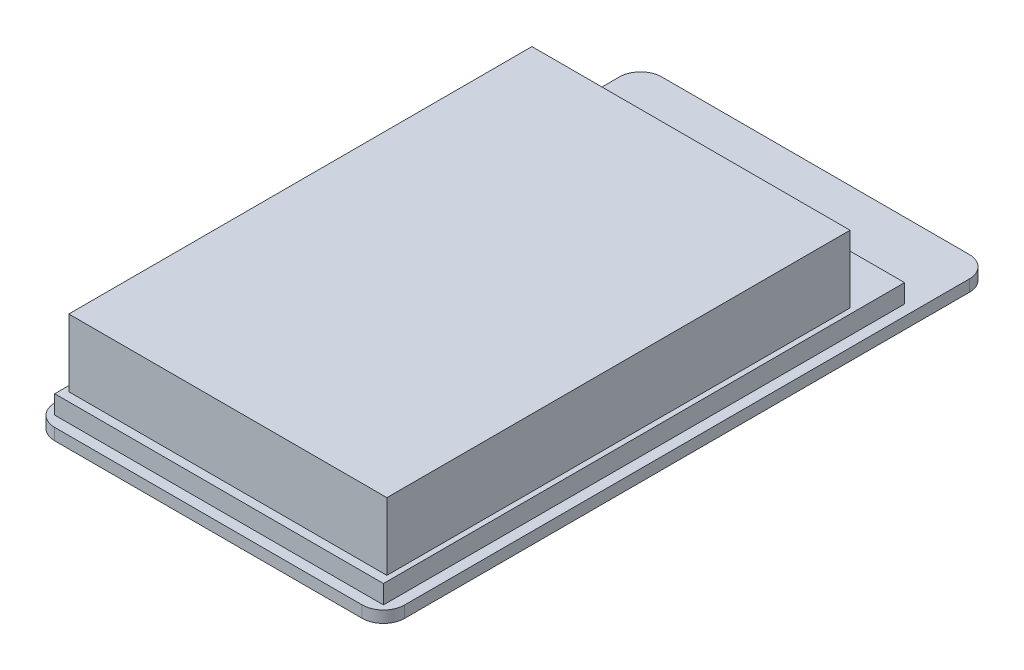
ISO-10303-21;
HEADER;
FILE_DESCRIPTION(('STEP AP214'),'2;1');
FILE_NAME('part.step','',(''),(''),'','','');
FILE_SCHEMA(('AUTOMOTIVE_DESIGN { 1 0 10303 214 1 1 1 1 }'));
ENDSEC;
DATA;
#1=APPLICATION_CONTEXT('core data for automotive mechanical design processes');
#2=APPLICATION_PROTOCOL_DEFINITION('international standard','automotive_design',2000,#1);
#3=PRODUCT_CONTEXT('',#1,'mechanical');
#4=PRODUCT('Part','Part','',(#3));
#5=PRODUCT_RELATED_PRODUCT_CATEGORY('part','',(#4));
#6=PRODUCT_DEFINITION_FORMATION('','',#4);
#7=PRODUCT_DEFINITION_CONTEXT('part definition',#1,'design');
#8=PRODUCT_DEFINITION('design','',#6,#7);
#9=PRODUCT_DEFINITION_SHAPE('','',#8);
#10=(LENGTH_UNIT() NAMED_UNIT(*) SI_UNIT(.MILLI.,.METRE.));
#11=(NAMED_UNIT(*) PLANE_ANGLE_UNIT() SI_UNIT($,.RADIAN.));
#12=(NAMED_UNIT(*) SI_UNIT($,.STERADIAN.) SOLID_ANGLE_UNIT());
#13=UNCERTAINTY_MEASURE_WITH_UNIT(LENGTH_MEASURE(1.E-05),#10,'distance_accuracy_value','');
#14=(GEOMETRIC_REPRESENTATION_CONTEXT(3) GLOBAL_UNCERTAINTY_ASSIGNED_CONTEXT((#13)) GLOBAL_UNIT_ASSIGNED_CONTEXT((#10,
#11,#12)) REPRESENTATION_CONTEXT('',''));
#15=CARTESIAN_POINT('',(0.,0.,0.));
#16=DIRECTION('',(0.,0.,1.));
#17=DIRECTION('',(1.,0.,0.));
#18=AXIS2_PLACEMENT_3D('',#15,#16,#17);
#19=CARTESIAN_POINT('',(0.,5.7,0.));
#20=DIRECTION('',(0.,1.,0.));
#21=DIRECTION('',(0.,0.,1.));
#22=AXIS2_PLACEMENT_3D('',#19,#20,#21);
#23=PLANE('',#22);
#24=DIRECTION('',(0.,0.,1.));
#25=VECTOR('',#24,1.);
#26=CARTESIAN_POINT('',(-31.,5.7,-43.05));
#27=LINE('',#26,#25);
#28=CARTESIAN_POINT('',(-31.,5.7,-43.05));
#29=VERTEX_POINT('',#28);
#30=CARTESIAN_POINT('',(-31.,5.7,55.25));
#31=VERTEX_POINT('',#30);
#32=EDGE_CURVE('E179',#29,#31,#27,.T.);
#33=ORIENTED_EDGE('',*,*,#32,.T.);
#34=DIRECTION('',(1.,0.,0.));
#35=VECTOR('',#34,1.);
#36=CARTESIAN_POINT('',(-31.,5.7,55.25));
#37=LINE('',#36,#35);
#38=CARTESIAN_POINT('',(31.,5.7,55.25));
#39=VERTEX_POINT('',#38);
#40=EDGE_CURVE('E182',#31,#39,#37,.T.);
#41=ORIENTED_EDGE('',*,*,#40,.T.);
#42=DIRECTION('',(0.,0.,-1.));
#43=VECTOR('',#42,1.);
#44=CARTESIAN_POINT('',(31.,5.7,-43.05));
#45=LINE('',#44,#43);
#46=CARTESIAN_POINT('',(31.,5.7,-43.05));
#47=VERTEX_POINT('',#46);
#48=EDGE_CURVE('E185',#39,#47,#45,.T.);
#49=ORIENTED_EDGE('',*,*,#48,.T.);
#50=DIRECTION('',(-1.,0.,0.));
#51=VECTOR('',#50,1.);
#52=CARTESIAN_POINT('',(-31.,5.7,-43.05));
#53=LINE('',#52,#51);
#54=EDGE_CURVE('E187',#47,#29,#53,.T.);
#55=ORIENTED_EDGE('',*,*,#54,.T.);
#56=EDGE_LOOP('',(#33,#41,#49,#55));
#57=FACE_BOUND('',#56,.T.);
#58=DIRECTION('',(1.,0.,0.));
#59=VECTOR('',#58,1.);
#60=CARTESIAN_POINT('',(-30.,5.7,53.6));
#61=LINE('',#60,#59);
#62=CARTESIAN_POINT('',(-30.,5.7,53.6));
#63=VERTEX_POINT('',#62);
#64=CARTESIAN_POINT('',(30.,5.7,53.6));
#65=VERTEX_POINT('',#64);
#66=EDGE_CURVE('E442',#63,#65,#61,.T.);
#67=ORIENTED_EDGE('',*,*,#66,.F.);
#68=DIRECTION('',(0.,0.,1.));
#69=VECTOR('',#68,1.);
#70=CARTESIAN_POINT('',(-30.,5.7,-33.7647170423504));
#71=LINE('',#70,#69);
#72=CARTESIAN_POINT('',(-30.,5.7,-33.7647170423504));
#73=VERTEX_POINT('',#72);
#74=EDGE_CURVE('E169',#73,#63,#71,.T.);
#75=ORIENTED_EDGE('',*,*,#74,.F.);
#76=DIRECTION('',(-1.,0.,0.));
#77=VECTOR('',#76,1.);
#78=CARTESIAN_POINT('',(-30.,5.7,-33.7647170423504));
#79=LINE('',#78,#77);
#80=CARTESIAN_POINT('',(30.,5.7,-33.7647170423504));
#81=VERTEX_POINT('',#80);
#82=EDGE_CURVE('E165',#81,#73,#79,.T.);
#83=ORIENTED_EDGE('',*,*,#82,.F.);
#84=DIRECTION('',(0.,0.,-1.));
#85=VECTOR('',#84,1.);
#86=CARTESIAN_POINT('',(30.,5.7,-33.7647170423504));
#87=LINE('',#86,#85);
#88=EDGE_CURVE('E439',#65,#81,#87,.T.);
#89=ORIENTED_EDGE('',*,*,#88,.F.);
#90=EDGE_LOOP('',(#67,#75,#83,#89));
#91=FACE_BOUND('',#90,.T.);
#92=ADVANCED_FACE('F32',(#57,#91),#23,.T.);
#93=CARTESIAN_POINT('',(0.,2.2,0.));
#94=DIRECTION('',(0.,1.,0.));
#95=DIRECTION('',(0.,0.,1.));
#96=AXIS2_PLACEMENT_3D('',#93,#94,#95);
#97=PLANE('',#96);
#98=DIRECTION('',(0.,0.,-1.));
#99=VECTOR('',#98,1.);
#100=CARTESIAN_POINT('',(33.,2.2,-57.25));
#101=LINE('',#100,#99);
#102=CARTESIAN_POINT('',(33.,2.2,53.25));
#103=VERTEX_POINT('',#102);
#104=CARTESIAN_POINT('',(33.,2.2,-53.25));
#105=VERTEX_POINT('',#104);
#106=EDGE_CURVE('E210',#103,#105,#101,.T.);
#107=ORIENTED_EDGE('',*,*,#106,.T.);
#108=CARTESIAN_POINT('',(29.,2.2,-53.25));
#109=DIRECTION('',(0.,1.,0.));
#110=DIRECTION('',(0.,0.,1.));
#111=AXIS2_PLACEMENT_3D('',#108,#109,#110);
#112=CIRCLE('',#111,4.);
#113=CARTESIAN_POINT('',(29.,2.2,-57.25));
#114=VERTEX_POINT('',#113);
#115=EDGE_CURVE('E250',#105,#114,#112,.T.);
#116=ORIENTED_EDGE('',*,*,#115,.T.);
#117=DIRECTION('',(-1.,0.,0.));
#118=VECTOR('',#117,1.);
#119=CARTESIAN_POINT('',(-33.,2.2,-57.25));
#120=LINE('',#119,#118);
#121=CARTESIAN_POINT('',(-29.,2.2,-57.25));
#122=VERTEX_POINT('',#121);
#123=EDGE_CURVE('E213',#114,#122,#120,.T.);
#124=ORIENTED_EDGE('',*,*,#123,.T.);
#125=CARTESIAN_POINT('',(-29.,2.2,-53.25));
#126=DIRECTION('',(0.,1.,0.));
#127=DIRECTION('',(0.,0.,1.));
#128=AXIS2_PLACEMENT_3D('',#125,#126,#127);
#129=CIRCLE('',#128,4.);
#130=CARTESIAN_POINT('',(-33.,2.2,-53.25));
#131=VERTEX_POINT('',#130);
#132=EDGE_CURVE('E248',#122,#131,#129,.T.);
#133=ORIENTED_EDGE('',*,*,#132,.T.);
#134=DIRECTION('',(0.,0.,1.));
#135=VECTOR('',#134,1.);
#136=CARTESIAN_POINT('',(-33.,2.2,-57.25));
#137=LINE('',#136,#135);
#138=CARTESIAN_POINT('',(-33.,2.2,53.25));
#139=VERTEX_POINT('',#138);
#140=EDGE_CURVE('E203',#131,#139,#137,.T.);
#141=ORIENTED_EDGE('',*,*,#140,.T.);
#142=CARTESIAN_POINT('',(-29.,2.2,53.25));
#143=DIRECTION('',(0.,1.,0.));
#144=DIRECTION('',(0.,0.,1.));
#145=AXIS2_PLACEMENT_3D('',#142,#143,#144);
#146=CIRCLE('',#145,4.);
#147=CARTESIAN_POINT('',(-29.,2.2,57.25));
#148=VERTEX_POINT('',#147);
#149=EDGE_CURVE('E246',#139,#148,#146,.T.);
#150=ORIENTED_EDGE('',*,*,#149,.T.);
#151=DIRECTION('',(1.,0.,0.));
#152=VECTOR('',#151,1.);
#153=CARTESIAN_POINT('',(-33.,2.2,57.25));
#154=LINE('',#153,#152);
#155=CARTESIAN_POINT('',(29.,2.2,57.25));
#156=VERTEX_POINT('',#155);
#157=EDGE_CURVE('E206',#148,#156,#154,.T.);
#158=ORIENTED_EDGE('',*,*,#157,.T.);
#159=CARTESIAN_POINT('',(29.,2.2,53.25));
#160=DIRECTION('',(0.,1.,0.));
#161=DIRECTION('',(0.,0.,1.));
#162=AXIS2_PLACEMENT_3D('',#159,#160,#161);
#163=CIRCLE('',#162,4.);
#164=EDGE_CURVE('E244',#156,#103,#163,.T.);
#165=ORIENTED_EDGE('',*,*,#164,.T.);
#166=EDGE_LOOP('',(#107,#116,#124,#133,#141,#150,#158,#165));
#167=FACE_BOUND('',#166,.T.);
#168=DIRECTION('',(1.,0.,0.));
#169=VECTOR('',#168,1.);
#170=CARTESIAN_POINT('',(-31.,2.2,55.25));
#171=LINE('',#170,#169);
#172=CARTESIAN_POINT('',(-31.,2.2,55.25));
#173=VERTEX_POINT('',#172);
#174=CARTESIAN_POINT('',(31.,2.2,55.25));
#175=VERTEX_POINT('',#174);
#176=EDGE_CURVE('E174',#173,#175,#171,.T.);
#177=ORIENTED_EDGE('',*,*,#176,.F.);
#178=DIRECTION('',(0.,0.,1.));
#179=VECTOR('',#178,1.);
#180=CARTESIAN_POINT('',(-31.,2.2,-43.05));
#181=LINE('',#180,#179);
#182=CARTESIAN_POINT('',(-31.,2.2,-43.05));
#183=VERTEX_POINT('',#182);
#184=EDGE_CURVE('E171',#183,#173,#181,.T.);
#185=ORIENTED_EDGE('',*,*,#184,.F.);
#186=DIRECTION('',(-1.,0.,0.));
#187=VECTOR('',#186,1.);
#188=CARTESIAN_POINT('',(-31.,2.2,-43.05));
#189=LINE('',#188,#187);
#190=CARTESIAN_POINT('',(31.,2.2,-43.05));
#191=VERTEX_POINT('',#190);
#192=EDGE_CURVE('E183',#191,#183,#189,.T.);
#193=ORIENTED_EDGE('',*,*,#192,.F.);
#194=DIRECTION('',(0.,0.,-1.));
#195=VECTOR('',#194,1.);
#196=CARTESIAN_POINT('',(31.,2.2,-43.05));
#197=LINE('',#196,#195);
#198=EDGE_CURVE('E191',#175,#191,#197,.T.);
#199=ORIENTED_EDGE('',*,*,#198,.F.);
#200=EDGE_LOOP('',(#177,#185,#193,#199));
#201=FACE_BOUND('',#200,.T.);
#202=ADVANCED_FACE('F265',(#167,#201),#97,.T.);
#203=CARTESIAN_POINT('',(-33.,2.2,-57.25));
#204=DIRECTION('',(1.,0.,0.));
#205=DIRECTION('',(0.,0.,-1.));
#206=AXIS2_PLACEMENT_3D('',#203,#204,#205);
#207=PLANE('',#206);
#208=ORIENTED_EDGE('',*,*,#140,.F.);
#209=DIRECTION('',(0.,-1.,0.));
#210=VECTOR('',#209,1.);
#211=CARTESIAN_POINT('',(-33.,2.2,-53.25));
#212=LINE('',#211,#210);
#213=CARTESIAN_POINT('',(-33.,0.,-53.25));
#214=VERTEX_POINT('',#213);
#215=EDGE_CURVE('E254',#131,#214,#212,.T.);
#216=ORIENTED_EDGE('',*,*,#215,.T.);
#217=DIRECTION('',(0.,0.,1.));
#218=VECTOR('',#217,1.);
#219=CARTESIAN_POINT('',(-33.,0.,-57.25));
#220=LINE('',#219,#218);
#221=CARTESIAN_POINT('',(-33.,0.,53.25));
#222=VERTEX_POINT('',#221);
#223=EDGE_CURVE('E202',#214,#222,#220,.T.);
#224=ORIENTED_EDGE('',*,*,#223,.T.);
#225=DIRECTION('',(0.,-1.,0.));
#226=VECTOR('',#225,1.);
#227=CARTESIAN_POINT('',(-33.,2.2,53.25));
#228=LINE('',#227,#226);
#229=EDGE_CURVE('E252',#222,#139,#228,.F.);
#230=ORIENTED_EDGE('',*,*,#229,.T.);
#231=EDGE_LOOP('',(#208,#216,#224,#230));
#232=FACE_BOUND('',#231,.T.);
#233=ADVANCED_FACE('F292',(#232),#207,.F.);
#234=CARTESIAN_POINT('',(-33.,2.2,57.25));
#235=DIRECTION('',(0.,0.,-1.));
#236=DIRECTION('',(-1.,0.,0.));
#237=AXIS2_PLACEMENT_3D('',#234,#235,#236);
#238=PLANE('',#237);
#239=ORIENTED_EDGE('',*,*,#157,.F.);
#240=DIRECTION('',(0.,-1.,0.));
#241=VECTOR('',#240,1.);
#242=CARTESIAN_POINT('',(-29.,2.2,57.25));
#243=LINE('',#242,#241);
#244=CARTESIAN_POINT('',(-29.,0.,57.25));
#245=VERTEX_POINT('',#244);
#246=EDGE_CURVE('E11',#148,#245,#243,.T.);
#247=ORIENTED_EDGE('',*,*,#246,.T.);
#248=DIRECTION('',(1.,0.,0.));
#249=VECTOR('',#248,1.);
#250=CARTESIAN_POINT('',(-33.,0.,57.25));
#251=LINE('',#250,#249);
#252=CARTESIAN_POINT('',(29.,0.,57.25));
#253=VERTEX_POINT('',#252);
#254=EDGE_CURVE('E219',#245,#253,#251,.T.);
#255=ORIENTED_EDGE('',*,*,#254,.T.);
#256=DIRECTION('',(0.,-1.,0.));
#257=VECTOR('',#256,1.);
#258=CARTESIAN_POINT('',(29.,2.2,57.25));
#259=LINE('',#258,#257);
#260=EDGE_CURVE('E40',#253,#156,#259,.F.);
#261=ORIENTED_EDGE('',*,*,#260,.T.);
#262=EDGE_LOOP('',(#239,#247,#255,#261));
#263=FACE_BOUND('',#262,.T.);
#264=ADVANCED_FACE('F259',(#263),#238,.F.);
#265=CARTESIAN_POINT('',(33.,2.2,-57.25));
#266=DIRECTION('',(-1.,0.,0.));
#267=DIRECTION('',(0.,0.,1.));
#268=AXIS2_PLACEMENT_3D('',#265,#266,#267);
#269=PLANE('',#268);
#270=DIRECTION('',(0.,0.,-1.));
#271=VECTOR('',#270,1.);
#272=CARTESIAN_POINT('',(33.,0.,-57.25));
#273=LINE('',#272,#271);
#274=CARTESIAN_POINT('',(33.,0.,53.25));
#275=VERTEX_POINT('',#274);
#276=CARTESIAN_POINT('',(33.,0.,-53.25));
#277=VERTEX_POINT('',#276);
#278=EDGE_CURVE('E222',#275,#277,#273,.T.);
#279=ORIENTED_EDGE('',*,*,#278,.T.);
#280=DIRECTION('',(0.,-1.,0.));
#281=VECTOR('',#280,1.);
#282=CARTESIAN_POINT('',(33.,2.2,-53.25));
#283=LINE('',#282,#281);
#284=EDGE_CURVE('E242',#277,#105,#283,.F.);
#285=ORIENTED_EDGE('',*,*,#284,.T.);
#286=ORIENTED_EDGE('',*,*,#106,.F.);
#287=DIRECTION('',(0.,-1.,0.));
#288=VECTOR('',#287,1.);
#289=CARTESIAN_POINT('',(33.,2.2,53.25));
#290=LINE('',#289,#288);
#291=EDGE_CURVE('E239',#103,#275,#290,.T.);
#292=ORIENTED_EDGE('',*,*,#291,.T.);
#293=EDGE_LOOP('',(#279,#285,#286,#292));
#294=FACE_BOUND('',#293,.T.);
#295=ADVANCED_FACE('F272',(#294),#269,.F.);
#296=CARTESIAN_POINT('',(-33.,2.2,-57.25));
#297=DIRECTION('',(0.,0.,1.));
#298=DIRECTION('',(1.,0.,0.));
#299=AXIS2_PLACEMENT_3D('',#296,#297,#298);
#300=PLANE('',#299);
#301=ORIENTED_EDGE('',*,*,#123,.F.);
#302=DIRECTION('',(0.,-1.,0.));
#303=VECTOR('',#302,1.);
#304=CARTESIAN_POINT('',(29.,2.2,-57.25));
#305=LINE('',#304,#303);
#306=CARTESIAN_POINT('',(29.,0.,-57.25));
#307=VERTEX_POINT('',#306);
#308=EDGE_CURVE('E228',#114,#307,#305,.T.);
#309=ORIENTED_EDGE('',*,*,#308,.T.);
#310=DIRECTION('',(-1.,0.,0.));
#311=VECTOR('',#310,1.);
#312=CARTESIAN_POINT('',(-33.,0.,-57.25));
#313=LINE('',#312,#311);
#314=CARTESIAN_POINT('',(-29.,0.,-57.25));
#315=VERTEX_POINT('',#314);
#316=EDGE_CURVE('E207',#307,#315,#313,.T.);
#317=ORIENTED_EDGE('',*,*,#316,.T.);
#318=DIRECTION('',(0.,-1.,0.));
#319=VECTOR('',#318,1.);
#320=CARTESIAN_POINT('',(-29.,2.2,-57.25));
#321=LINE('',#320,#319);
#322=EDGE_CURVE('E216',#315,#122,#321,.F.);
#323=ORIENTED_EDGE('',*,*,#322,.T.);
#324=EDGE_LOOP('',(#301,#309,#317,#323));
#325=FACE_BOUND('',#324,.T.);
#326=ADVANCED_FACE('F283',(#325),#300,.F.);
#327=CARTESIAN_POINT('',(0.,0.,0.));
#328=DIRECTION('',(0.,1.,0.));
#329=DIRECTION('',(0.,0.,1.));
#330=AXIS2_PLACEMENT_3D('',#327,#328,#329);
#331=PLANE('',#330);
#332=ORIENTED_EDGE('',*,*,#316,.F.);
#333=CARTESIAN_POINT('',(29.,0.,-53.25));
#334=DIRECTION('',(0.,1.,0.));
#335=DIRECTION('',(0.,0.,1.));
#336=AXIS2_PLACEMENT_3D('',#333,#334,#335);
#337=CIRCLE('',#336,4.);
#338=EDGE_CURVE('E237',#307,#277,#337,.F.);
#339=ORIENTED_EDGE('',*,*,#338,.T.);
#340=ORIENTED_EDGE('',*,*,#278,.F.);
#341=CARTESIAN_POINT('',(29.,0.,53.25));
#342=DIRECTION('',(0.,1.,0.));
#343=DIRECTION('',(0.,0.,1.));
#344=AXIS2_PLACEMENT_3D('',#341,#342,#343);
#345=CIRCLE('',#344,4.);
#346=EDGE_CURVE('E231',#275,#253,#345,.F.);
#347=ORIENTED_EDGE('',*,*,#346,.T.);
#348=ORIENTED_EDGE('',*,*,#254,.F.);
#349=CARTESIAN_POINT('',(-29.,0.,53.25));
#350=DIRECTION('',(0.,1.,0.));
#351=DIRECTION('',(0.,0.,1.));
#352=AXIS2_PLACEMENT_3D('',#349,#350,#351);
#353=CIRCLE('',#352,4.);
#354=EDGE_CURVE('E233',#245,#222,#353,.F.);
#355=ORIENTED_EDGE('',*,*,#354,.T.);
#356=ORIENTED_EDGE('',*,*,#223,.F.);
#357=CARTESIAN_POINT('',(-29.,0.,-53.25));
#358=DIRECTION('',(0.,1.,0.));
#359=DIRECTION('',(0.,0.,1.));
#360=AXIS2_PLACEMENT_3D('',#357,#358,#359);
#361=CIRCLE('',#360,4.);
#362=EDGE_CURVE('E235',#214,#315,#361,.F.);
#363=ORIENTED_EDGE('',*,*,#362,.T.);
#364=EDGE_LOOP('',(#332,#339,#340,#347,#348,#355,#356,#363));
#365=FACE_BOUND('',#364,.T.);
#366=ADVANCED_FACE('F276',(#365),#331,.F.);
#367=CARTESIAN_POINT('',(29.,2.2,-53.25));
#368=DIRECTION('',(0.,-1.,0.));
#369=DIRECTION('',(0.,0.,-1.));
#370=AXIS2_PLACEMENT_3D('',#367,#368,#369);
#371=CYLINDRICAL_SURFACE('',#370,4.);
#372=ORIENTED_EDGE('',*,*,#115,.F.);
#373=ORIENTED_EDGE('',*,*,#284,.F.);
#374=ORIENTED_EDGE('',*,*,#338,.F.);
#375=ORIENTED_EDGE('',*,*,#308,.F.);
#376=EDGE_LOOP('',(#372,#373,#374,#375));
#377=FACE_BOUND('',#376,.T.);
#378=ADVANCED_FACE('F280',(#377),#371,.T.);
#379=CARTESIAN_POINT('',(-29.,2.2,-53.25));
#380=DIRECTION('',(0.,-1.,0.));
#381=DIRECTION('',(0.,0.,-1.));
#382=AXIS2_PLACEMENT_3D('',#379,#380,#381);
#383=CYLINDRICAL_SURFACE('',#382,4.);
#384=ORIENTED_EDGE('',*,*,#132,.F.);
#385=ORIENTED_EDGE('',*,*,#322,.F.);
#386=ORIENTED_EDGE('',*,*,#362,.F.);
#387=ORIENTED_EDGE('',*,*,#215,.F.);
#388=EDGE_LOOP('',(#384,#385,#386,#387));
#389=FACE_BOUND('',#388,.T.);
#390=ADVANCED_FACE('F289',(#389),#383,.T.);
#391=CARTESIAN_POINT('',(-29.,2.2,53.25));
#392=DIRECTION('',(0.,-1.,0.));
#393=DIRECTION('',(0.,0.,-1.));
#394=AXIS2_PLACEMENT_3D('',#391,#392,#393);
#395=CYLINDRICAL_SURFACE('',#394,4.);
#396=ORIENTED_EDGE('',*,*,#149,.F.);
#397=ORIENTED_EDGE('',*,*,#229,.F.);
#398=ORIENTED_EDGE('',*,*,#354,.F.);
#399=ORIENTED_EDGE('',*,*,#246,.F.);
#400=EDGE_LOOP('',(#396,#397,#398,#399));
#401=FACE_BOUND('',#400,.T.);
#402=ADVANCED_FACE('F295',(#401),#395,.T.);
#403=CARTESIAN_POINT('',(29.,2.2,53.25));
#404=DIRECTION('',(0.,-1.,0.));
#405=DIRECTION('',(0.,0.,-1.));
#406=AXIS2_PLACEMENT_3D('',#403,#404,#405);
#407=CYLINDRICAL_SURFACE('',#406,4.);
#408=ORIENTED_EDGE('',*,*,#164,.F.);
#409=ORIENTED_EDGE('',*,*,#260,.F.);
#410=ORIENTED_EDGE('',*,*,#346,.F.);
#411=ORIENTED_EDGE('',*,*,#291,.F.);
#412=EDGE_LOOP('',(#408,#409,#410,#411));
#413=FACE_BOUND('',#412,.T.);
#414=ADVANCED_FACE('F34',(#413),#407,.T.);
#415=CARTESIAN_POINT('',(-31.,5.7,-43.05));
#416=DIRECTION('',(1.,0.,0.));
#417=DIRECTION('',(0.,0.,-1.));
#418=AXIS2_PLACEMENT_3D('',#415,#416,#417);
#419=PLANE('',#418);
#420=ORIENTED_EDGE('',*,*,#184,.T.);
#421=DIRECTION('',(0.,-1.,0.));
#422=VECTOR('',#421,1.);
#423=CARTESIAN_POINT('',(-31.,5.7,55.25));
#424=LINE('',#423,#422);
#425=EDGE_CURVE('E200',#31,#173,#424,.T.);
#426=ORIENTED_EDGE('',*,*,#425,.F.);
#427=ORIENTED_EDGE('',*,*,#32,.F.);
#428=DIRECTION('',(0.,-1.,0.));
#429=VECTOR('',#428,1.);
#430=CARTESIAN_POINT('',(-31.,5.7,-43.05));
#431=LINE('',#430,#429);
#432=EDGE_CURVE('E188',#29,#183,#431,.T.);
#433=ORIENTED_EDGE('',*,*,#432,.T.);
#434=EDGE_LOOP('',(#420,#426,#427,#433));
#435=FACE_BOUND('',#434,.T.);
#436=ADVANCED_FACE('F301',(#435),#419,.F.);
#437=CARTESIAN_POINT('',(-31.,5.7,55.25));
#438=DIRECTION('',(0.,0.,-1.));
#439=DIRECTION('',(-1.,0.,0.));
#440=AXIS2_PLACEMENT_3D('',#437,#438,#439);
#441=PLANE('',#440);
#442=ORIENTED_EDGE('',*,*,#176,.T.);
#443=DIRECTION('',(0.,-1.,0.));
#444=VECTOR('',#443,1.);
#445=CARTESIAN_POINT('',(31.,5.7,55.25));
#446=LINE('',#445,#444);
#447=EDGE_CURVE('E197',#39,#175,#446,.T.);
#448=ORIENTED_EDGE('',*,*,#447,.F.);
#449=ORIENTED_EDGE('',*,*,#40,.F.);
#450=ORIENTED_EDGE('',*,*,#425,.T.);
#451=EDGE_LOOP('',(#442,#448,#449,#450));
#452=FACE_BOUND('',#451,.T.);
#453=ADVANCED_FACE('F320',(#452),#441,.F.);
#454=CARTESIAN_POINT('',(31.,5.7,-43.05));
#455=DIRECTION('',(-1.,0.,0.));
#456=DIRECTION('',(0.,0.,1.));
#457=AXIS2_PLACEMENT_3D('',#454,#455,#456);
#458=PLANE('',#457);
#459=ORIENTED_EDGE('',*,*,#198,.T.);
#460=DIRECTION('',(0.,-1.,0.));
#461=VECTOR('',#460,1.);
#462=CARTESIAN_POINT('',(31.,5.7,-43.05));
#463=LINE('',#462,#461);
#464=EDGE_CURVE('E55',#47,#191,#463,.T.);
#465=ORIENTED_EDGE('',*,*,#464,.F.);
#466=ORIENTED_EDGE('',*,*,#48,.F.);
#467=ORIENTED_EDGE('',*,*,#447,.T.);
#468=EDGE_LOOP('',(#459,#465,#466,#467));
#469=FACE_BOUND('',#468,.T.);
#470=ADVANCED_FACE('F317',(#469),#458,.F.);
#471=CARTESIAN_POINT('',(-31.,5.7,-43.05));
#472=DIRECTION('',(0.,0.,1.));
#473=DIRECTION('',(1.,0.,0.));
#474=AXIS2_PLACEMENT_3D('',#471,#472,#473);
#475=PLANE('',#474);
#476=ORIENTED_EDGE('',*,*,#192,.T.);
#477=ORIENTED_EDGE('',*,*,#432,.F.);
#478=ORIENTED_EDGE('',*,*,#54,.F.);
#479=ORIENTED_EDGE('',*,*,#464,.T.);
#480=EDGE_LOOP('',(#476,#477,#478,#479));
#481=FACE_BOUND('',#480,.T.);
#482=ADVANCED_FACE('F314',(#481),#475,.F.);
#483=CARTESIAN_POINT('',(-30.,18.4,-33.7647170423504));
#484=DIRECTION('',(1.,0.,0.));
#485=DIRECTION('',(0.,0.,-1.));
#486=AXIS2_PLACEMENT_3D('',#483,#484,#485);
#487=PLANE('',#486);
#488=ORIENTED_EDGE('',*,*,#74,.T.);
#489=DIRECTION('',(0.,-1.,0.));
#490=VECTOR('',#489,1.);
#491=CARTESIAN_POINT('',(-30.,18.4,53.6));
#492=LINE('',#491,#490);
#493=CARTESIAN_POINT('',(-30.,18.4,53.6));
#494=VERTEX_POINT('',#493);
#495=EDGE_CURVE('E150',#494,#63,#492,.T.);
#496=ORIENTED_EDGE('',*,*,#495,.F.);
#497=DIRECTION('',(0.,0.,1.));
#498=VECTOR('',#497,1.);
#499=CARTESIAN_POINT('',(-30.,18.4,-33.7647170423504));
#500=LINE('',#499,#498);
#501=CARTESIAN_POINT('',(-30.,18.4,-33.7647170423504));
#502=VERTEX_POINT('',#501);
#503=EDGE_CURVE('E157',#502,#494,#500,.T.);
#504=ORIENTED_EDGE('',*,*,#503,.F.);
#505=DIRECTION('',(0.,-1.,0.));
#506=VECTOR('',#505,1.);
#507=CARTESIAN_POINT('',(-30.,18.4,-33.7647170423504));
#508=LINE('',#507,#506);
#509=EDGE_CURVE('E437',#502,#73,#508,.T.);
#510=ORIENTED_EDGE('',*,*,#509,.T.);
#511=EDGE_LOOP('',(#488,#496,#504,#510));
#512=FACE_BOUND('',#511,.T.);
#513=ADVANCED_FACE('F167',(#512),#487,.F.);
#514=CARTESIAN_POINT('',(-30.,18.4,53.6));
#515=DIRECTION('',(0.,0.,-1.));
#516=DIRECTION('',(-1.,0.,0.));
#517=AXIS2_PLACEMENT_3D('',#514,#515,#516);
#518=PLANE('',#517);
#519=ORIENTED_EDGE('',*,*,#66,.T.);
#520=DIRECTION('',(0.,-1.,0.));
#521=VECTOR('',#520,1.);
#522=CARTESIAN_POINT('',(30.,18.4,53.6));
#523=LINE('',#522,#521);
#524=CARTESIAN_POINT('',(30.,18.4,53.6));
#525=VERTEX_POINT('',#524);
#526=EDGE_CURVE('E153',#525,#65,#523,.T.);
#527=ORIENTED_EDGE('',*,*,#526,.F.);
#528=DIRECTION('',(1.,0.,0.));
#529=VECTOR('',#528,1.);
#530=CARTESIAN_POINT('',(-30.,18.4,53.6));
#531=LINE('',#530,#529);
#532=EDGE_CURVE('E146',#494,#525,#531,.T.);
#533=ORIENTED_EDGE('',*,*,#532,.F.);
#534=ORIENTED_EDGE('',*,*,#495,.T.);
#535=EDGE_LOOP('',(#519,#527,#533,#534));
#536=FACE_BOUND('',#535,.T.);
#537=ADVANCED_FACE('F148',(#536),#518,.F.);
#538=CARTESIAN_POINT('',(30.,18.4,-33.7647170423504));
#539=DIRECTION('',(-1.,0.,0.));
#540=DIRECTION('',(0.,0.,1.));
#541=AXIS2_PLACEMENT_3D('',#538,#539,#540);
#542=PLANE('',#541);
#543=ORIENTED_EDGE('',*,*,#88,.T.);
#544=DIRECTION('',(0.,-1.,0.));
#545=VECTOR('',#544,1.);
#546=CARTESIAN_POINT('',(30.,18.4,-33.7647170423504));
#547=LINE('',#546,#545);
#548=CARTESIAN_POINT('',(30.,18.4,-33.7647170423504));
#549=VERTEX_POINT('',#548);
#550=EDGE_CURVE('E47',#549,#81,#547,.T.);
#551=ORIENTED_EDGE('',*,*,#550,.F.);
#552=DIRECTION('',(0.,0.,-1.));
#553=VECTOR('',#552,1.);
#554=CARTESIAN_POINT('',(30.,18.4,-33.7647170423504));
#555=LINE('',#554,#553);
#556=EDGE_CURVE('E156',#525,#549,#555,.T.);
#557=ORIENTED_EDGE('',*,*,#556,.F.);
#558=ORIENTED_EDGE('',*,*,#526,.T.);
#559=EDGE_LOOP('',(#543,#551,#557,#558));
#560=FACE_BOUND('',#559,.T.);
#561=ADVANCED_FACE('F407',(#560),#542,.F.);
#562=CARTESIAN_POINT('',(-30.,18.4,-33.7647170423504));
#563=DIRECTION('',(0.,0.,1.));
#564=DIRECTION('',(1.,0.,0.));
#565=AXIS2_PLACEMENT_3D('',#562,#563,#564);
#566=PLANE('',#565);
#567=ORIENTED_EDGE('',*,*,#82,.T.);
#568=ORIENTED_EDGE('',*,*,#509,.F.);
#569=DIRECTION('',(-1.,0.,0.));
#570=VECTOR('',#569,1.);
#571=CARTESIAN_POINT('',(-30.,18.4,-33.7647170423504));
#572=LINE('',#571,#570);
#573=EDGE_CURVE('E161',#549,#502,#572,.T.);
#574=ORIENTED_EDGE('',*,*,#573,.F.);
#575=ORIENTED_EDGE('',*,*,#550,.T.);
#576=EDGE_LOOP('',(#567,#568,#574,#575));
#577=FACE_BOUND('',#576,.T.);
#578=ADVANCED_FACE('F415',(#577),#566,.F.);
#579=CARTESIAN_POINT('',(0.,18.4,0.));
#580=DIRECTION('',(0.,1.,0.));
#581=DIRECTION('',(0.,0.,1.));
#582=AXIS2_PLACEMENT_3D('',#579,#580,#581);
#583=PLANE('',#582);
#584=ORIENTED_EDGE('',*,*,#503,.T.);
#585=ORIENTED_EDGE('',*,*,#532,.T.);
#586=ORIENTED_EDGE('',*,*,#556,.T.);
#587=ORIENTED_EDGE('',*,*,#573,.T.);
#588=EDGE_LOOP('',(#584,#585,#586,#587));
#589=FACE_BOUND('',#588,.T.);
#590=ADVANCED_FACE('F160',(#589),#583,.T.);
#591=CLOSED_SHELL('',(#92,#202,#233,#264,#295,#326,#366,#378,#390,#402,#414,#436,#453,#470,#482,
#513,#537,#561,#578,#590));
#592=MANIFOLD_SOLID_BREP('B2',#591);
#593=ADVANCED_BREP_SHAPE_REPRESENTATION('',(#18,#592),#14);
#594=SHAPE_DEFINITION_REPRESENTATION(#9,#593);
ENDSEC;
END-ISO-10303-21;
